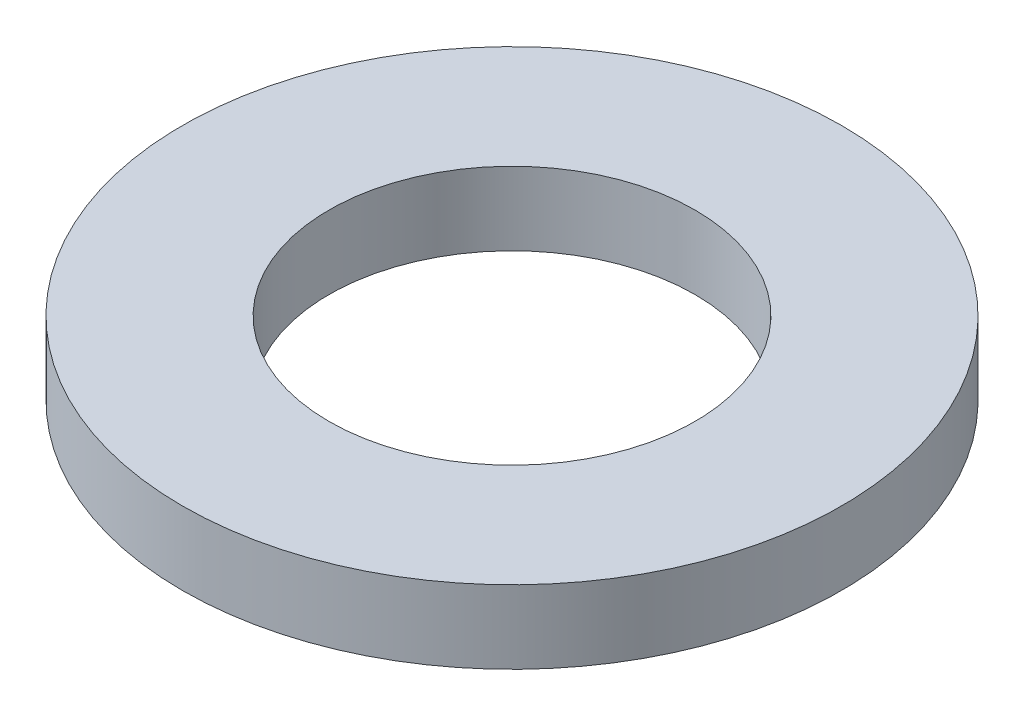
ISO-10303-21;
HEADER;
FILE_DESCRIPTION(('STEP AP214'),'2;1');
FILE_NAME('part.step','',(''),(''),'','','');
FILE_SCHEMA(('AUTOMOTIVE_DESIGN { 1 0 10303 214 1 1 1 1 }'));
ENDSEC;
DATA;
#1=APPLICATION_CONTEXT('core data for automotive mechanical design processes');
#2=APPLICATION_PROTOCOL_DEFINITION('international standard','automotive_design',2000,#1);
#3=PRODUCT_CONTEXT('',#1,'mechanical');
#4=PRODUCT('Part','Part','',(#3));
#5=PRODUCT_RELATED_PRODUCT_CATEGORY('part','',(#4));
#6=PRODUCT_DEFINITION_FORMATION('','',#4);
#7=PRODUCT_DEFINITION_CONTEXT('part definition',#1,'design');
#8=PRODUCT_DEFINITION('design','',#6,#7);
#9=PRODUCT_DEFINITION_SHAPE('','',#8);
#10=(LENGTH_UNIT() NAMED_UNIT(*) SI_UNIT(.MILLI.,.METRE.));
#11=(NAMED_UNIT(*) PLANE_ANGLE_UNIT() SI_UNIT($,.RADIAN.));
#12=(NAMED_UNIT(*) SI_UNIT($,.STERADIAN.) SOLID_ANGLE_UNIT());
#13=UNCERTAINTY_MEASURE_WITH_UNIT(LENGTH_MEASURE(1.E-05),#10,'distance_accuracy_value','');
#14=(GEOMETRIC_REPRESENTATION_CONTEXT(3) GLOBAL_UNCERTAINTY_ASSIGNED_CONTEXT((#13)) GLOBAL_UNIT_ASSIGNED_CONTEXT((#10,
#11,#12)) REPRESENTATION_CONTEXT('',''));
#15=CARTESIAN_POINT('',(0.,0.,0.));
#16=DIRECTION('',(0.,0.,1.));
#17=DIRECTION('',(1.,0.,0.));
#18=AXIS2_PLACEMENT_3D('',#15,#16,#17);
#19=CARTESIAN_POINT('',(0.,1.,0.));
#20=DIRECTION('',(0.,1.,0.));
#21=DIRECTION('',(0.,0.,1.));
#22=AXIS2_PLACEMENT_3D('',#19,#20,#21);
#23=PLANE('',#22);
#24=CARTESIAN_POINT('',(0.,1.,0.));
#25=DIRECTION('',(0.,1.,0.));
#26=DIRECTION('',(0.,0.,1.));
#27=AXIS2_PLACEMENT_3D('',#24,#25,#26);
#28=CIRCLE('',#27,4.5);
#29=CARTESIAN_POINT('',(0.,1.,4.5));
#30=VERTEX_POINT('',#29);
#31=EDGE_CURVE('E10',#30,#30,#28,.T.);
#32=ORIENTED_EDGE('',*,*,#31,.T.);
#33=EDGE_LOOP('',(#32));
#34=FACE_BOUND('',#33,.T.);
#35=CARTESIAN_POINT('',(0.,1.,0.));
#36=DIRECTION('',(0.,1.,0.));
#37=DIRECTION('',(0.,0.,1.));
#38=AXIS2_PLACEMENT_3D('',#35,#36,#37);
#39=CIRCLE('',#38,2.5);
#40=CARTESIAN_POINT('',(0.,1.,2.5));
#41=VERTEX_POINT('',#40);
#42=EDGE_CURVE('E43',#41,#41,#39,.T.);
#43=ORIENTED_EDGE('',*,*,#42,.F.);
#44=EDGE_LOOP('',(#43));
#45=FACE_BOUND('',#44,.T.);
#46=ADVANCED_FACE('F32',(#34,#45),#23,.T.);
#47=CARTESIAN_POINT('',(0.,0.,0.));
#48=DIRECTION('',(0.,1.,0.));
#49=DIRECTION('',(0.,0.,1.));
#50=AXIS2_PLACEMENT_3D('',#47,#48,#49);
#51=PLANE('',#50);
#52=CARTESIAN_POINT('',(0.,0.,0.));
#53=DIRECTION('',(0.,1.,0.));
#54=DIRECTION('',(0.,0.,1.));
#55=AXIS2_PLACEMENT_3D('',#52,#53,#54);
#56=CIRCLE('',#55,4.5);
#57=CARTESIAN_POINT('',(0.,0.,4.5));
#58=VERTEX_POINT('',#57);
#59=EDGE_CURVE('E36',#58,#58,#56,.T.);
#60=ORIENTED_EDGE('',*,*,#59,.F.);
#61=EDGE_LOOP('',(#60));
#62=FACE_BOUND('',#61,.T.);
#63=CARTESIAN_POINT('',(0.,0.,0.));
#64=DIRECTION('',(0.,1.,0.));
#65=DIRECTION('',(0.,0.,1.));
#66=AXIS2_PLACEMENT_3D('',#63,#64,#65);
#67=CIRCLE('',#66,2.5);
#68=CARTESIAN_POINT('',(0.,0.,2.5));
#69=VERTEX_POINT('',#68);
#70=EDGE_CURVE('E45',#69,#69,#67,.T.);
#71=ORIENTED_EDGE('',*,*,#70,.T.);
#72=EDGE_LOOP('',(#71));
#73=FACE_BOUND('',#72,.T.);
#74=ADVANCED_FACE('F55',(#62,#73),#51,.F.);
#75=CARTESIAN_POINT('',(0.,1.,0.));
#76=DIRECTION('',(0.,-1.,0.));
#77=DIRECTION('',(0.,0.,-1.));
#78=AXIS2_PLACEMENT_3D('',#75,#76,#77);
#79=CYLINDRICAL_SURFACE('',#78,4.5);
#80=ORIENTED_EDGE('',*,*,#31,.F.);
#81=EDGE_LOOP('',(#80));
#82=FACE_BOUND('',#81,.T.);
#83=ORIENTED_EDGE('',*,*,#59,.T.);
#84=EDGE_LOOP('',(#83));
#85=FACE_BOUND('',#84,.T.);
#86=ADVANCED_FACE('F34',(#82,#85),#79,.T.);
#87=CARTESIAN_POINT('',(0.,1.,0.));
#88=DIRECTION('',(0.,-1.,0.));
#89=DIRECTION('',(0.,0.,-1.));
#90=AXIS2_PLACEMENT_3D('',#87,#88,#89);
#91=CYLINDRICAL_SURFACE('',#90,2.5);
#92=ORIENTED_EDGE('',*,*,#42,.T.);
#93=EDGE_LOOP('',(#92));
#94=FACE_BOUND('',#93,.T.);
#95=ORIENTED_EDGE('',*,*,#70,.F.);
#96=EDGE_LOOP('',(#95));
#97=FACE_BOUND('',#96,.T.);
#98=ADVANCED_FACE('F51',(#94,#97),#91,.F.);
#99=CLOSED_SHELL('',(#46,#74,#86,#98));
#100=MANIFOLD_SOLID_BREP('B2',#99);
#101=ADVANCED_BREP_SHAPE_REPRESENTATION('',(#18,#100),#14);
#102=SHAPE_DEFINITION_REPRESENTATION(#9,#101);
ENDSEC;
END-ISO-10303-21;
